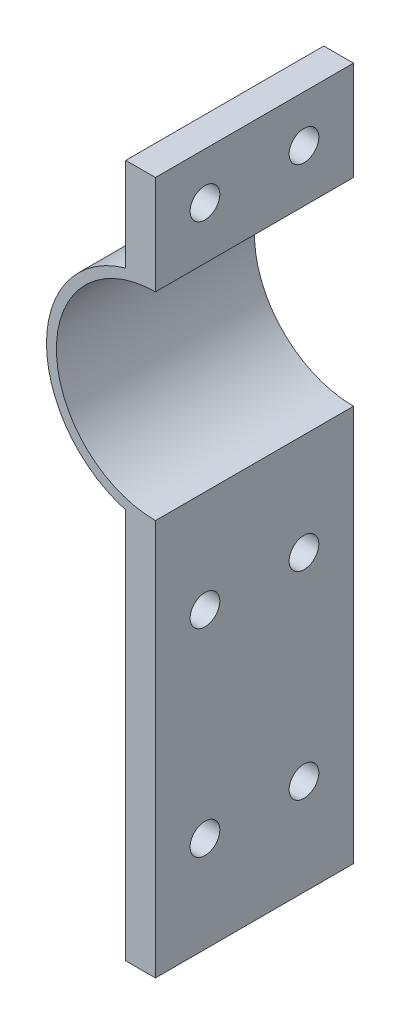
ISO-10303-21;
HEADER;
FILE_DESCRIPTION(('STEP AP214'),'2;1');
FILE_NAME('part.step','',(''),(''),'','','');
FILE_SCHEMA(('AUTOMOTIVE_DESIGN { 1 0 10303 214 1 1 1 1 }'));
ENDSEC;
DATA;
#1=APPLICATION_CONTEXT('core data for automotive mechanical design processes');
#2=APPLICATION_PROTOCOL_DEFINITION('international standard','automotive_design',2000,#1);
#3=PRODUCT_CONTEXT('',#1,'mechanical');
#4=PRODUCT('Part','Part','',(#3));
#5=PRODUCT_RELATED_PRODUCT_CATEGORY('part','',(#4));
#6=PRODUCT_DEFINITION_FORMATION('','',#4);
#7=PRODUCT_DEFINITION_CONTEXT('part definition',#1,'design');
#8=PRODUCT_DEFINITION('design','',#6,#7);
#9=PRODUCT_DEFINITION_SHAPE('','',#8);
#10=(LENGTH_UNIT() NAMED_UNIT(*) SI_UNIT(.MILLI.,.METRE.));
#11=(NAMED_UNIT(*) PLANE_ANGLE_UNIT() SI_UNIT($,.RADIAN.));
#12=(NAMED_UNIT(*) SI_UNIT($,.STERADIAN.) SOLID_ANGLE_UNIT());
#13=UNCERTAINTY_MEASURE_WITH_UNIT(LENGTH_MEASURE(1.E-05),#10,'distance_accuracy_value','');
#14=(GEOMETRIC_REPRESENTATION_CONTEXT(3) GLOBAL_UNCERTAINTY_ASSIGNED_CONTEXT((#13)) GLOBAL_UNIT_ASSIGNED_CONTEXT((#10,
#11,#12)) REPRESENTATION_CONTEXT('',''));
#15=CARTESIAN_POINT('',(0.,0.,0.));
#16=DIRECTION('',(0.,0.,1.));
#17=DIRECTION('',(1.,0.,0.));
#18=AXIS2_PLACEMENT_3D('',#15,#16,#17);
#19=CARTESIAN_POINT('',(-3.,0.,20.));
#20=DIRECTION('',(1.,0.,0.));
#21=DIRECTION('',(0.,1.,0.));
#22=AXIS2_PLACEMENT_3D('',#19,#20,#21);
#23=PLANE('',#22);
#24=CARTESIAN_POINT('',(-3.,15.2915026221292,5.));
#25=DIRECTION('',(-1.,0.,0.));
#26=DIRECTION('',(0.,0.,1.));
#27=AXIS2_PLACEMENT_3D('',#24,#25,#26);
#28=CIRCLE('',#27,1.5);
#29=CARTESIAN_POINT('',(-3.,15.2915026221292,6.5));
#30=VERTEX_POINT('',#29);
#31=EDGE_CURVE('E175',#30,#30,#28,.T.);
#32=ORIENTED_EDGE('',*,*,#31,.F.);
#33=EDGE_LOOP('',(#32));
#34=FACE_BOUND('',#33,.T.);
#35=CARTESIAN_POINT('',(-3.,15.2915026221292,15.));
#36=DIRECTION('',(-1.,0.,0.));
#37=DIRECTION('',(0.,0.,1.));
#38=AXIS2_PLACEMENT_3D('',#35,#36,#37);
#39=CIRCLE('',#38,1.5);
#40=CARTESIAN_POINT('',(-3.,15.2915026221292,16.5));
#41=VERTEX_POINT('',#40);
#42=EDGE_CURVE('E233',#41,#41,#39,.T.);
#43=ORIENTED_EDGE('',*,*,#42,.F.);
#44=EDGE_LOOP('',(#43));
#45=FACE_BOUND('',#44,.T.);
#46=DIRECTION('',(0.,-1.,0.));
#47=VECTOR('',#46,1.);
#48=CARTESIAN_POINT('',(-3.,0.,0.));
#49=LINE('',#48,#47);
#50=CARTESIAN_POINT('',(-3.,20.,0.));
#51=VERTEX_POINT('',#50);
#52=CARTESIAN_POINT('',(-3.,10.5830052442584,0.));
#53=VERTEX_POINT('',#52);
#54=EDGE_CURVE('E140',#51,#53,#49,.T.);
#55=ORIENTED_EDGE('',*,*,#54,.T.);
#56=DIRECTION('',(0.,0.,-1.));
#57=VECTOR('',#56,1.);
#58=CARTESIAN_POINT('',(-3.,10.5830052442584,20.));
#59=LINE('',#58,#57);
#60=CARTESIAN_POINT('',(-3.,10.5830052442584,20.));
#61=VERTEX_POINT('',#60);
#62=EDGE_CURVE('E11',#61,#53,#59,.T.);
#63=ORIENTED_EDGE('',*,*,#62,.F.);
#64=DIRECTION('',(0.,-1.,0.));
#65=VECTOR('',#64,1.);
#66=CARTESIAN_POINT('',(-3.,0.,20.));
#67=LINE('',#66,#65);
#68=CARTESIAN_POINT('',(-3.,20.,20.));
#69=VERTEX_POINT('',#68);
#70=EDGE_CURVE('E159',#69,#61,#67,.T.);
#71=ORIENTED_EDGE('',*,*,#70,.F.);
#72=DIRECTION('',(0.,0.,-1.));
#73=VECTOR('',#72,1.);
#74=CARTESIAN_POINT('',(-3.,20.,20.));
#75=LINE('',#74,#73);
#76=EDGE_CURVE('E139',#69,#51,#75,.T.);
#77=ORIENTED_EDGE('',*,*,#76,.T.);
#78=EDGE_LOOP('',(#55,#63,#71,#77));
#79=FACE_BOUND('',#78,.T.);
#80=ADVANCED_FACE('F40',(#34,#45,#79),#23,.F.);
#81=CARTESIAN_POINT('',(0.,0.,20.));
#82=DIRECTION('',(0.,0.,-1.));
#83=DIRECTION('',(-1.,0.,0.));
#84=AXIS2_PLACEMENT_3D('',#81,#82,#83);
#85=CYLINDRICAL_SURFACE('',#84,11.);
#86=CARTESIAN_POINT('',(0.,0.,0.));
#87=DIRECTION('',(0.,0.,1.));
#88=DIRECTION('',(1.,0.,0.));
#89=AXIS2_PLACEMENT_3D('',#86,#87,#88);
#90=CIRCLE('',#89,11.);
#91=CARTESIAN_POINT('',(-3.,-10.5830052442584,0.));
#92=VERTEX_POINT('',#91);
#93=EDGE_CURVE('E143',#53,#92,#90,.T.);
#94=ORIENTED_EDGE('',*,*,#93,.T.);
#95=DIRECTION('',(0.,0.,-1.));
#96=VECTOR('',#95,1.);
#97=CARTESIAN_POINT('',(-3.,-10.5830052442584,20.));
#98=LINE('',#97,#96);
#99=CARTESIAN_POINT('',(-3.,-10.5830052442584,20.));
#100=VERTEX_POINT('',#99);
#101=EDGE_CURVE('E49',#100,#92,#98,.T.);
#102=ORIENTED_EDGE('',*,*,#101,.F.);
#103=CARTESIAN_POINT('',(0.,0.,20.));
#104=DIRECTION('',(0.,0.,1.));
#105=DIRECTION('',(1.,0.,0.));
#106=AXIS2_PLACEMENT_3D('',#103,#104,#105);
#107=CIRCLE('',#106,11.);
#108=EDGE_CURVE('E100',#61,#100,#107,.T.);
#109=ORIENTED_EDGE('',*,*,#108,.F.);
#110=ORIENTED_EDGE('',*,*,#62,.T.);
#111=EDGE_LOOP('',(#94,#102,#109,#110));
#112=FACE_BOUND('',#111,.T.);
#113=ADVANCED_FACE('F222',(#112),#85,.T.);
#114=CARTESIAN_POINT('',(-3.,0.,20.));
#115=DIRECTION('',(-1.,0.,0.));
#116=DIRECTION('',(0.,-1.,0.));
#117=AXIS2_PLACEMENT_3D('',#114,#115,#116);
#118=PLANE('',#117);
#119=CARTESIAN_POINT('',(-3.,-20.2915026221292,15.));
#120=DIRECTION('',(-1.,0.,0.));
#121=DIRECTION('',(0.,0.,1.));
#122=AXIS2_PLACEMENT_3D('',#119,#120,#121);
#123=CIRCLE('',#122,1.5);
#124=CARTESIAN_POINT('',(-3.,-20.2915026221292,16.5));
#125=VERTEX_POINT('',#124);
#126=EDGE_CURVE('E279',#125,#125,#123,.T.);
#127=ORIENTED_EDGE('',*,*,#126,.F.);
#128=EDGE_LOOP('',(#127));
#129=FACE_BOUND('',#128,.T.);
#130=CARTESIAN_POINT('',(-3.,-40.2915026221292,15.));
#131=DIRECTION('',(-1.,0.,0.));
#132=DIRECTION('',(0.,0.,-1.));
#133=AXIS2_PLACEMENT_3D('',#130,#131,#132);
#134=CIRCLE('',#133,1.5);
#135=CARTESIAN_POINT('',(-3.,-40.2915026221292,13.5));
#136=VERTEX_POINT('',#135);
#137=EDGE_CURVE('E283',#136,#136,#134,.T.);
#138=ORIENTED_EDGE('',*,*,#137,.F.);
#139=EDGE_LOOP('',(#138));
#140=FACE_BOUND('',#139,.T.);
#141=CARTESIAN_POINT('',(-3.,-40.2915026221292,5.));
#142=DIRECTION('',(-1.,0.,0.));
#143=DIRECTION('',(0.,0.,-1.));
#144=AXIS2_PLACEMENT_3D('',#141,#142,#143);
#145=CIRCLE('',#144,1.5);
#146=CARTESIAN_POINT('',(-3.,-40.2915026221292,3.5));
#147=VERTEX_POINT('',#146);
#148=EDGE_CURVE('E193',#147,#147,#145,.T.);
#149=ORIENTED_EDGE('',*,*,#148,.F.);
#150=EDGE_LOOP('',(#149));
#151=FACE_BOUND('',#150,.T.);
#152=CARTESIAN_POINT('',(-3.,-20.2915026221292,5.));
#153=DIRECTION('',(-1.,0.,0.));
#154=DIRECTION('',(0.,0.,1.));
#155=AXIS2_PLACEMENT_3D('',#152,#153,#154);
#156=CIRCLE('',#155,1.5);
#157=CARTESIAN_POINT('',(-3.,-20.2915026221292,6.5));
#158=VERTEX_POINT('',#157);
#159=EDGE_CURVE('E170',#158,#158,#156,.T.);
#160=ORIENTED_EDGE('',*,*,#159,.F.);
#161=EDGE_LOOP('',(#160));
#162=FACE_BOUND('',#161,.T.);
#163=DIRECTION('',(0.,1.,0.));
#164=VECTOR('',#163,1.);
#165=CARTESIAN_POINT('',(-3.,0.,0.));
#166=LINE('',#165,#164);
#167=CARTESIAN_POINT('',(-3.,-50.,0.));
#168=VERTEX_POINT('',#167);
#169=EDGE_CURVE('E147',#168,#92,#166,.T.);
#170=ORIENTED_EDGE('',*,*,#169,.F.);
#171=DIRECTION('',(0.,0.,-1.));
#172=VECTOR('',#171,1.);
#173=CARTESIAN_POINT('',(-3.,-50.,20.));
#174=LINE('',#173,#172);
#175=CARTESIAN_POINT('',(-3.,-50.,20.));
#176=VERTEX_POINT('',#175);
#177=EDGE_CURVE('E165',#176,#168,#174,.T.);
#178=ORIENTED_EDGE('',*,*,#177,.F.);
#179=DIRECTION('',(0.,1.,0.));
#180=VECTOR('',#179,1.);
#181=CARTESIAN_POINT('',(-3.,0.,20.));
#182=LINE('',#181,#180);
#183=EDGE_CURVE('E197',#176,#100,#182,.T.);
#184=ORIENTED_EDGE('',*,*,#183,.T.);
#185=ORIENTED_EDGE('',*,*,#101,.T.);
#186=EDGE_LOOP('',(#170,#178,#184,#185));
#187=FACE_BOUND('',#186,.T.);
#188=ADVANCED_FACE('F206',(#129,#140,#151,#162,#187),#118,.T.);
#189=CARTESIAN_POINT('',(0.,-50.,20.));
#190=DIRECTION('',(0.,-1.,0.));
#191=DIRECTION('',(0.,0.,-1.));
#192=AXIS2_PLACEMENT_3D('',#189,#190,#191);
#193=PLANE('',#192);
#194=DIRECTION('',(-1.,0.,0.));
#195=VECTOR('',#194,1.);
#196=CARTESIAN_POINT('',(0.,-50.,0.));
#197=LINE('',#196,#195);
#198=CARTESIAN_POINT('',(0.,-50.,0.));
#199=VERTEX_POINT('',#198);
#200=EDGE_CURVE('E150',#199,#168,#197,.T.);
#201=ORIENTED_EDGE('',*,*,#200,.F.);
#202=DIRECTION('',(0.,0.,-1.));
#203=VECTOR('',#202,1.);
#204=CARTESIAN_POINT('',(0.,-50.,20.));
#205=LINE('',#204,#203);
#206=CARTESIAN_POINT('',(0.,-50.,20.));
#207=VERTEX_POINT('',#206);
#208=EDGE_CURVE('E163',#207,#199,#205,.T.);
#209=ORIENTED_EDGE('',*,*,#208,.F.);
#210=DIRECTION('',(-1.,0.,0.));
#211=VECTOR('',#210,1.);
#212=CARTESIAN_POINT('',(0.,-50.,20.));
#213=LINE('',#212,#211);
#214=EDGE_CURVE('E134',#207,#176,#213,.T.);
#215=ORIENTED_EDGE('',*,*,#214,.T.);
#216=ORIENTED_EDGE('',*,*,#177,.T.);
#217=EDGE_LOOP('',(#201,#209,#215,#216));
#218=FACE_BOUND('',#217,.T.);
#219=ADVANCED_FACE('F202',(#218),#193,.T.);
#220=CARTESIAN_POINT('',(0.,0.,20.));
#221=DIRECTION('',(-1.,0.,0.));
#222=DIRECTION('',(0.,0.,1.));
#223=AXIS2_PLACEMENT_3D('',#220,#221,#222);
#224=PLANE('',#223);
#225=CARTESIAN_POINT('',(0.,-20.2915026221292,15.));
#226=DIRECTION('',(-1.,0.,0.));
#227=DIRECTION('',(0.,0.,1.));
#228=AXIS2_PLACEMENT_3D('',#225,#226,#227);
#229=CIRCLE('',#228,1.5);
#230=CARTESIAN_POINT('',(0.,-20.2915026221292,16.5));
#231=VERTEX_POINT('',#230);
#232=EDGE_CURVE('E43',#231,#231,#229,.T.);
#233=ORIENTED_EDGE('',*,*,#232,.T.);
#234=EDGE_LOOP('',(#233));
#235=FACE_BOUND('',#234,.T.);
#236=CARTESIAN_POINT('',(0.,-40.2915026221292,15.));
#237=DIRECTION('',(-1.,0.,0.));
#238=DIRECTION('',(0.,0.,1.));
#239=AXIS2_PLACEMENT_3D('',#236,#237,#238);
#240=CIRCLE('',#239,1.5);
#241=CARTESIAN_POINT('',(0.,-40.2915026221292,16.5));
#242=VERTEX_POINT('',#241);
#243=EDGE_CURVE('E180',#242,#242,#240,.T.);
#244=ORIENTED_EDGE('',*,*,#243,.T.);
#245=EDGE_LOOP('',(#244));
#246=FACE_BOUND('',#245,.T.);
#247=CARTESIAN_POINT('',(0.,-40.2915026221292,5.));
#248=DIRECTION('',(-1.,0.,0.));
#249=DIRECTION('',(0.,0.,1.));
#250=AXIS2_PLACEMENT_3D('',#247,#248,#249);
#251=CIRCLE('',#250,1.5);
#252=CARTESIAN_POINT('',(0.,-40.2915026221292,6.5));
#253=VERTEX_POINT('',#252);
#254=EDGE_CURVE('E178',#253,#253,#251,.T.);
#255=ORIENTED_EDGE('',*,*,#254,.T.);
#256=EDGE_LOOP('',(#255));
#257=FACE_BOUND('',#256,.T.);
#258=CARTESIAN_POINT('',(0.,-20.2915026221292,5.));
#259=DIRECTION('',(-1.,0.,0.));
#260=DIRECTION('',(0.,0.,1.));
#261=AXIS2_PLACEMENT_3D('',#258,#259,#260);
#262=CIRCLE('',#261,1.5);
#263=CARTESIAN_POINT('',(0.,-20.2915026221292,6.5));
#264=VERTEX_POINT('',#263);
#265=EDGE_CURVE('E144',#264,#264,#262,.T.);
#266=ORIENTED_EDGE('',*,*,#265,.T.);
#267=EDGE_LOOP('',(#266));
#268=FACE_BOUND('',#267,.T.);
#269=DIRECTION('',(0.,1.,0.));
#270=VECTOR('',#269,1.);
#271=CARTESIAN_POINT('',(0.,0.,0.));
#272=LINE('',#271,#270);
#273=CARTESIAN_POINT('',(0.,-10.,0.));
#274=VERTEX_POINT('',#273);
#275=EDGE_CURVE('E153',#199,#274,#272,.T.);
#276=ORIENTED_EDGE('',*,*,#275,.T.);
#277=DIRECTION('',(0.,0.,-1.));
#278=VECTOR('',#277,1.);
#279=CARTESIAN_POINT('',(0.,-10.,20.));
#280=LINE('',#279,#278);
#281=CARTESIAN_POINT('',(0.,-10.,20.));
#282=VERTEX_POINT('',#281);
#283=EDGE_CURVE('E122',#282,#274,#280,.T.);
#284=ORIENTED_EDGE('',*,*,#283,.F.);
#285=DIRECTION('',(0.,1.,0.));
#286=VECTOR('',#285,1.);
#287=CARTESIAN_POINT('',(0.,0.,20.));
#288=LINE('',#287,#286);
#289=EDGE_CURVE('E131',#207,#282,#288,.T.);
#290=ORIENTED_EDGE('',*,*,#289,.F.);
#291=ORIENTED_EDGE('',*,*,#208,.T.);
#292=EDGE_LOOP('',(#276,#284,#290,#291));
#293=FACE_BOUND('',#292,.T.);
#294=ADVANCED_FACE('F212',(#235,#246,#257,#268,#293),#224,.F.);
#295=CARTESIAN_POINT('',(0.,0.,20.));
#296=DIRECTION('',(0.,0.,-1.));
#297=DIRECTION('',(-1.,0.,0.));
#298=AXIS2_PLACEMENT_3D('',#295,#296,#297);
#299=CYLINDRICAL_SURFACE('',#298,10.);
#300=CARTESIAN_POINT('',(0.,0.,0.));
#301=DIRECTION('',(0.,0.,1.));
#302=DIRECTION('',(1.,0.,0.));
#303=AXIS2_PLACEMENT_3D('',#300,#301,#302);
#304=CIRCLE('',#303,10.);
#305=CARTESIAN_POINT('',(0.,10.,0.));
#306=VERTEX_POINT('',#305);
#307=EDGE_CURVE('E121',#306,#274,#304,.T.);
#308=ORIENTED_EDGE('',*,*,#307,.F.);
#309=DIRECTION('',(0.,0.,-1.));
#310=VECTOR('',#309,1.);
#311=CARTESIAN_POINT('',(0.,10.,20.));
#312=LINE('',#311,#310);
#313=CARTESIAN_POINT('',(0.,10.,20.));
#314=VERTEX_POINT('',#313);
#315=EDGE_CURVE('E115',#314,#306,#312,.T.);
#316=ORIENTED_EDGE('',*,*,#315,.F.);
#317=CARTESIAN_POINT('',(0.,0.,20.));
#318=DIRECTION('',(0.,0.,1.));
#319=DIRECTION('',(1.,0.,0.));
#320=AXIS2_PLACEMENT_3D('',#317,#318,#319);
#321=CIRCLE('',#320,10.);
#322=EDGE_CURVE('E119',#314,#282,#321,.T.);
#323=ORIENTED_EDGE('',*,*,#322,.T.);
#324=ORIENTED_EDGE('',*,*,#283,.T.);
#325=EDGE_LOOP('',(#308,#316,#323,#324));
#326=FACE_BOUND('',#325,.T.);
#327=ADVANCED_FACE('F117',(#326),#299,.F.);
#328=CARTESIAN_POINT('',(0.,0.,20.));
#329=DIRECTION('',(-1.,0.,0.));
#330=DIRECTION('',(0.,0.,1.));
#331=AXIS2_PLACEMENT_3D('',#328,#329,#330);
#332=PLANE('',#331);
#333=CARTESIAN_POINT('',(0.,15.2915026221292,5.));
#334=DIRECTION('',(-1.,0.,0.));
#335=DIRECTION('',(0.,0.,1.));
#336=AXIS2_PLACEMENT_3D('',#333,#334,#335);
#337=CIRCLE('',#336,1.5);
#338=CARTESIAN_POINT('',(0.,15.2915026221292,6.5));
#339=VERTEX_POINT('',#338);
#340=EDGE_CURVE('E174',#339,#339,#337,.T.);
#341=ORIENTED_EDGE('',*,*,#340,.T.);
#342=EDGE_LOOP('',(#341));
#343=FACE_BOUND('',#342,.T.);
#344=CARTESIAN_POINT('',(0.,15.2915026221292,15.));
#345=DIRECTION('',(-1.,0.,0.));
#346=DIRECTION('',(0.,0.,1.));
#347=AXIS2_PLACEMENT_3D('',#344,#345,#346);
#348=CIRCLE('',#347,1.5);
#349=CARTESIAN_POINT('',(0.,15.2915026221292,16.5));
#350=VERTEX_POINT('',#349);
#351=EDGE_CURVE('E171',#350,#350,#348,.T.);
#352=ORIENTED_EDGE('',*,*,#351,.T.);
#353=EDGE_LOOP('',(#352));
#354=FACE_BOUND('',#353,.T.);
#355=DIRECTION('',(0.,1.,0.));
#356=VECTOR('',#355,1.);
#357=CARTESIAN_POINT('',(0.,0.,0.));
#358=LINE('',#357,#356);
#359=CARTESIAN_POINT('',(0.,20.,0.));
#360=VERTEX_POINT('',#359);
#361=EDGE_CURVE('E86',#306,#360,#358,.T.);
#362=ORIENTED_EDGE('',*,*,#361,.T.);
#363=DIRECTION('',(0.,0.,-1.));
#364=VECTOR('',#363,1.);
#365=CARTESIAN_POINT('',(0.,20.,20.));
#366=LINE('',#365,#364);
#367=CARTESIAN_POINT('',(0.,20.,20.));
#368=VERTEX_POINT('',#367);
#369=EDGE_CURVE('E123',#368,#360,#366,.T.);
#370=ORIENTED_EDGE('',*,*,#369,.F.);
#371=DIRECTION('',(0.,1.,0.));
#372=VECTOR('',#371,1.);
#373=CARTESIAN_POINT('',(0.,0.,20.));
#374=LINE('',#373,#372);
#375=EDGE_CURVE('E125',#314,#368,#374,.T.);
#376=ORIENTED_EDGE('',*,*,#375,.F.);
#377=ORIENTED_EDGE('',*,*,#315,.T.);
#378=EDGE_LOOP('',(#362,#370,#376,#377));
#379=FACE_BOUND('',#378,.T.);
#380=ADVANCED_FACE('F126',(#343,#354,#379),#332,.F.);
#381=CARTESIAN_POINT('',(0.,20.,20.));
#382=DIRECTION('',(0.,-1.,0.));
#383=DIRECTION('',(0.,0.,-1.));
#384=AXIS2_PLACEMENT_3D('',#381,#382,#383);
#385=PLANE('',#384);
#386=DIRECTION('',(-1.,0.,0.));
#387=VECTOR('',#386,1.);
#388=CARTESIAN_POINT('',(0.,20.,0.));
#389=LINE('',#388,#387);
#390=EDGE_CURVE('E92',#360,#51,#389,.T.);
#391=ORIENTED_EDGE('',*,*,#390,.T.);
#392=ORIENTED_EDGE('',*,*,#76,.F.);
#393=DIRECTION('',(-1.,0.,0.));
#394=VECTOR('',#393,1.);
#395=CARTESIAN_POINT('',(0.,20.,20.));
#396=LINE('',#395,#394);
#397=EDGE_CURVE('E58',#368,#69,#396,.T.);
#398=ORIENTED_EDGE('',*,*,#397,.F.);
#399=ORIENTED_EDGE('',*,*,#369,.T.);
#400=EDGE_LOOP('',(#391,#392,#398,#399));
#401=FACE_BOUND('',#400,.T.);
#402=ADVANCED_FACE('F236',(#401),#385,.F.);
#403=CARTESIAN_POINT('',(0.,0.,20.));
#404=DIRECTION('',(0.,0.,1.));
#405=DIRECTION('',(1.,0.,0.));
#406=AXIS2_PLACEMENT_3D('',#403,#404,#405);
#407=PLANE('',#406);
#408=ORIENTED_EDGE('',*,*,#70,.T.);
#409=ORIENTED_EDGE('',*,*,#108,.T.);
#410=ORIENTED_EDGE('',*,*,#183,.F.);
#411=ORIENTED_EDGE('',*,*,#214,.F.);
#412=ORIENTED_EDGE('',*,*,#289,.T.);
#413=ORIENTED_EDGE('',*,*,#322,.F.);
#414=ORIENTED_EDGE('',*,*,#375,.T.);
#415=ORIENTED_EDGE('',*,*,#397,.T.);
#416=EDGE_LOOP('',(#408,#409,#410,#411,#412,#413,#414,#415));
#417=FACE_BOUND('',#416,.T.);
#418=ADVANCED_FACE('F128',(#417),#407,.T.);
#419=CARTESIAN_POINT('',(0.,0.,0.));
#420=DIRECTION('',(0.,0.,1.));
#421=DIRECTION('',(1.,0.,0.));
#422=AXIS2_PLACEMENT_3D('',#419,#420,#421);
#423=PLANE('',#422);
#424=ORIENTED_EDGE('',*,*,#54,.F.);
#425=ORIENTED_EDGE('',*,*,#390,.F.);
#426=ORIENTED_EDGE('',*,*,#361,.F.);
#427=ORIENTED_EDGE('',*,*,#307,.T.);
#428=ORIENTED_EDGE('',*,*,#275,.F.);
#429=ORIENTED_EDGE('',*,*,#200,.T.);
#430=ORIENTED_EDGE('',*,*,#169,.T.);
#431=ORIENTED_EDGE('',*,*,#93,.F.);
#432=EDGE_LOOP('',(#424,#425,#426,#427,#428,#429,#430,#431));
#433=FACE_BOUND('',#432,.T.);
#434=ADVANCED_FACE('F210',(#433),#423,.F.);
#435=CARTESIAN_POINT('',(17.,-20.2915026221292,5.));
#436=DIRECTION('',(-1.,0.,0.));
#437=DIRECTION('',(0.,0.,1.));
#438=AXIS2_PLACEMENT_3D('',#435,#436,#437);
#439=CYLINDRICAL_SURFACE('',#438,1.5);
#440=ORIENTED_EDGE('',*,*,#159,.T.);
#441=EDGE_LOOP('',(#440));
#442=FACE_BOUND('',#441,.T.);
#443=ORIENTED_EDGE('',*,*,#265,.F.);
#444=EDGE_LOOP('',(#443));
#445=FACE_BOUND('',#444,.T.);
#446=ADVANCED_FACE('F248',(#442,#445),#439,.F.);
#447=CARTESIAN_POINT('',(17.,15.2915026221292,15.));
#448=DIRECTION('',(-1.,0.,0.));
#449=DIRECTION('',(0.,0.,1.));
#450=AXIS2_PLACEMENT_3D('',#447,#448,#449);
#451=CYLINDRICAL_SURFACE('',#450,1.5);
#452=ORIENTED_EDGE('',*,*,#42,.T.);
#453=EDGE_LOOP('',(#452));
#454=FACE_BOUND('',#453,.T.);
#455=ORIENTED_EDGE('',*,*,#351,.F.);
#456=EDGE_LOOP('',(#455));
#457=FACE_BOUND('',#456,.T.);
#458=ADVANCED_FACE('F252',(#454,#457),#451,.F.);
#459=CARTESIAN_POINT('',(17.,15.2915026221292,5.));
#460=DIRECTION('',(-1.,0.,0.));
#461=DIRECTION('',(0.,0.,1.));
#462=AXIS2_PLACEMENT_3D('',#459,#460,#461);
#463=CYLINDRICAL_SURFACE('',#462,1.5);
#464=ORIENTED_EDGE('',*,*,#31,.T.);
#465=EDGE_LOOP('',(#464));
#466=FACE_BOUND('',#465,.T.);
#467=ORIENTED_EDGE('',*,*,#340,.F.);
#468=EDGE_LOOP('',(#467));
#469=FACE_BOUND('',#468,.T.);
#470=ADVANCED_FACE('F257',(#466,#469),#463,.F.);
#471=CARTESIAN_POINT('',(17.,-40.2915026221292,5.));
#472=DIRECTION('',(-1.,0.,0.));
#473=DIRECTION('',(0.,0.,1.));
#474=AXIS2_PLACEMENT_3D('',#471,#472,#473);
#475=CYLINDRICAL_SURFACE('',#474,1.5);
#476=ORIENTED_EDGE('',*,*,#148,.T.);
#477=EDGE_LOOP('',(#476));
#478=FACE_BOUND('',#477,.T.);
#479=ORIENTED_EDGE('',*,*,#254,.F.);
#480=EDGE_LOOP('',(#479));
#481=FACE_BOUND('',#480,.T.);
#482=ADVANCED_FACE('F253',(#478,#481),#475,.F.);
#483=CARTESIAN_POINT('',(17.,-40.2915026221292,15.));
#484=DIRECTION('',(-1.,0.,0.));
#485=DIRECTION('',(0.,0.,1.));
#486=AXIS2_PLACEMENT_3D('',#483,#484,#485);
#487=CYLINDRICAL_SURFACE('',#486,1.5);
#488=ORIENTED_EDGE('',*,*,#137,.T.);
#489=EDGE_LOOP('',(#488));
#490=FACE_BOUND('',#489,.T.);
#491=ORIENTED_EDGE('',*,*,#243,.F.);
#492=EDGE_LOOP('',(#491));
#493=FACE_BOUND('',#492,.T.);
#494=ADVANCED_FACE('F256',(#490,#493),#487,.F.);
#495=CARTESIAN_POINT('',(17.,-20.2915026221292,15.));
#496=DIRECTION('',(-1.,0.,0.));
#497=DIRECTION('',(0.,0.,1.));
#498=AXIS2_PLACEMENT_3D('',#495,#496,#497);
#499=CYLINDRICAL_SURFACE('',#498,1.5);
#500=ORIENTED_EDGE('',*,*,#126,.T.);
#501=EDGE_LOOP('',(#500));
#502=FACE_BOUND('',#501,.T.);
#503=ORIENTED_EDGE('',*,*,#232,.F.);
#504=EDGE_LOOP('',(#503));
#505=FACE_BOUND('',#504,.T.);
#506=ADVANCED_FACE('F261',(#502,#505),#499,.F.);
#507=CLOSED_SHELL('',(#80,#113,#188,#219,#294,#327,#380,#402,#418,#434,#446,#458,#470,#482,#494,#506));
#508=MANIFOLD_SOLID_BREP('B2',#507);
#509=ADVANCED_BREP_SHAPE_REPRESENTATION('',(#18,#508),#14);
#510=SHAPE_DEFINITION_REPRESENTATION(#9,#509);
ENDSEC;
END-ISO-10303-21;
